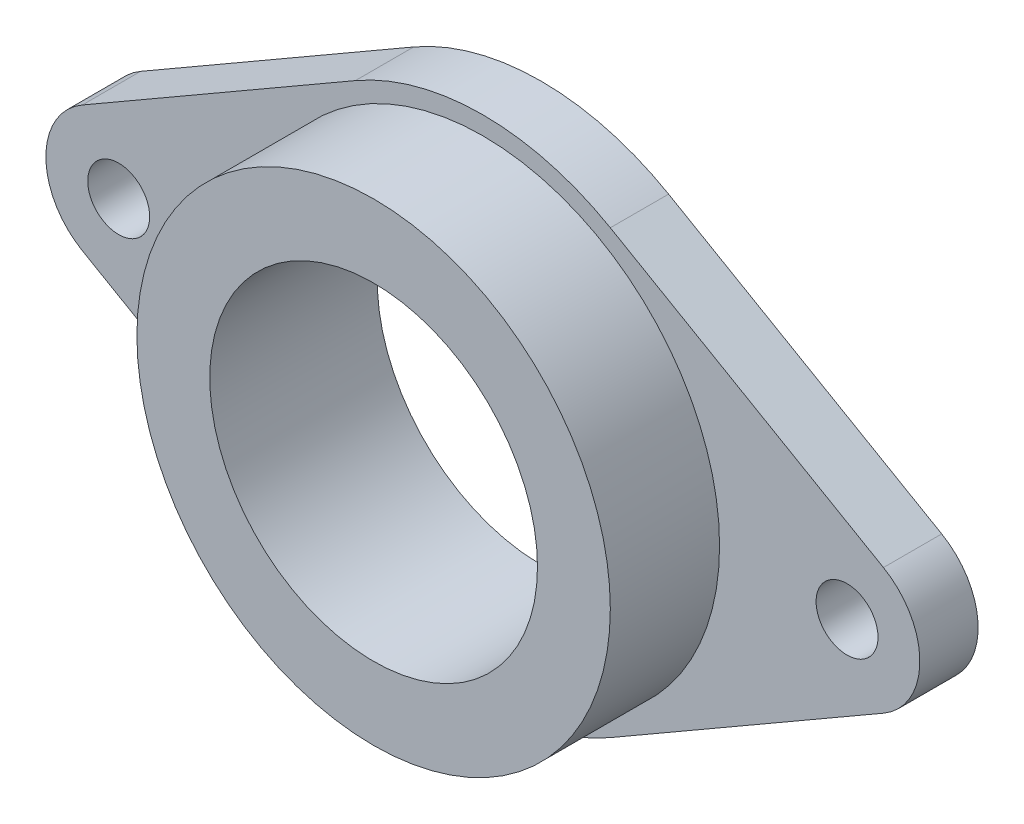
ISO-10303-21;
HEADER;
FILE_DESCRIPTION(('STEP AP214'),'2;1');
FILE_NAME('part.step','',(''),(''),'','','');
FILE_SCHEMA(('AUTOMOTIVE_DESIGN { 1 0 10303 214 1 1 1 1 }'));
ENDSEC;
DATA;
#1=APPLICATION_CONTEXT('core data for automotive mechanical design processes');
#2=APPLICATION_PROTOCOL_DEFINITION('international standard','automotive_design',2000,#1);
#3=PRODUCT_CONTEXT('',#1,'mechanical');
#4=PRODUCT('Part','Part','',(#3));
#5=PRODUCT_RELATED_PRODUCT_CATEGORY('part','',(#4));
#6=PRODUCT_DEFINITION_FORMATION('','',#4);
#7=PRODUCT_DEFINITION_CONTEXT('part definition',#1,'design');
#8=PRODUCT_DEFINITION('design','',#6,#7);
#9=PRODUCT_DEFINITION_SHAPE('','',#8);
#10=(LENGTH_UNIT() NAMED_UNIT(*) SI_UNIT(.MILLI.,.METRE.));
#11=(NAMED_UNIT(*) PLANE_ANGLE_UNIT() SI_UNIT($,.RADIAN.));
#12=(NAMED_UNIT(*) SI_UNIT($,.STERADIAN.) SOLID_ANGLE_UNIT());
#13=UNCERTAINTY_MEASURE_WITH_UNIT(LENGTH_MEASURE(1.E-05),#10,'distance_accuracy_value','');
#14=(GEOMETRIC_REPRESENTATION_CONTEXT(3) GLOBAL_UNCERTAINTY_ASSIGNED_CONTEXT((#13)) GLOBAL_UNIT_ASSIGNED_CONTEXT((#10,
#11,#12)) REPRESENTATION_CONTEXT('',''));
#15=CARTESIAN_POINT('',(0.,0.,0.));
#16=DIRECTION('',(0.,0.,1.));
#17=DIRECTION('',(1.,0.,0.));
#18=AXIS2_PLACEMENT_3D('',#15,#16,#17);
#19=CARTESIAN_POINT('',(17.5,30.3108891324553,8.));
#20=DIRECTION('',(0.5,0.866025403784438,0.));
#21=DIRECTION('',(-0.866025403784439,0.5,0.));
#22=AXIS2_PLACEMENT_3D('',#19,#20,#21);
#23=PLANE('',#22);
#24=DIRECTION('',(0.866025403784439,-0.5,0.));
#25=VECTOR('',#24,1.);
#26=CARTESIAN_POINT('',(17.5,30.3108891324553,0.));
#27=LINE('',#26,#25);
#28=CARTESIAN_POINT('',(17.5,30.3108891324553,0.));
#29=VERTEX_POINT('',#28);
#30=CARTESIAN_POINT('',(55.,8.66025403784437,0.));
#31=VERTEX_POINT('',#30);
#32=EDGE_CURVE('E156',#29,#31,#27,.T.);
#33=ORIENTED_EDGE('',*,*,#32,.F.);
#34=DIRECTION('',(0.,0.,-1.));
#35=VECTOR('',#34,1.);
#36=CARTESIAN_POINT('',(17.5,30.3108891324553,8.));
#37=LINE('',#36,#35);
#38=CARTESIAN_POINT('',(17.5,30.3108891324553,8.));
#39=VERTEX_POINT('',#38);
#40=EDGE_CURVE('E11',#39,#29,#37,.T.);
#41=ORIENTED_EDGE('',*,*,#40,.F.);
#42=DIRECTION('',(0.866025403784439,-0.5,0.));
#43=VECTOR('',#42,1.);
#44=CARTESIAN_POINT('',(17.5,30.3108891324553,8.));
#45=LINE('',#44,#43);
#46=CARTESIAN_POINT('',(55.,8.66025403784437,8.));
#47=VERTEX_POINT('',#46);
#48=EDGE_CURVE('E256',#39,#47,#45,.T.);
#49=ORIENTED_EDGE('',*,*,#48,.T.);
#50=DIRECTION('',(0.,0.,-1.));
#51=VECTOR('',#50,1.);
#52=CARTESIAN_POINT('',(55.,8.66025403784437,8.));
#53=LINE('',#52,#51);
#54=EDGE_CURVE('E58',#47,#31,#53,.T.);
#55=ORIENTED_EDGE('',*,*,#54,.T.);
#56=EDGE_LOOP('',(#33,#41,#49,#55));
#57=FACE_BOUND('',#56,.T.);
#58=ADVANCED_FACE('F41',(#57),#23,.T.);
#59=CARTESIAN_POINT('',(0.,0.,8.));
#60=DIRECTION('',(0.,0.,-1.));
#61=DIRECTION('',(-1.,0.,0.));
#62=AXIS2_PLACEMENT_3D('',#59,#60,#61);
#63=CYLINDRICAL_SURFACE('',#62,35.);
#64=CARTESIAN_POINT('',(0.,0.,0.));
#65=DIRECTION('',(0.,0.,1.));
#66=DIRECTION('',(1.,0.,0.));
#67=AXIS2_PLACEMENT_3D('',#64,#65,#66);
#68=CIRCLE('',#67,35.);
#69=CARTESIAN_POINT('',(-17.5,30.3108891324554,0.));
#70=VERTEX_POINT('',#69);
#71=EDGE_CURVE('E153',#29,#70,#68,.T.);
#72=ORIENTED_EDGE('',*,*,#71,.T.);
#73=DIRECTION('',(0.,0.,-1.));
#74=VECTOR('',#73,1.);
#75=CARTESIAN_POINT('',(-17.5,30.3108891324554,8.));
#76=LINE('',#75,#74);
#77=CARTESIAN_POINT('',(-17.5,30.3108891324554,8.));
#78=VERTEX_POINT('',#77);
#79=EDGE_CURVE('E50',#78,#70,#76,.T.);
#80=ORIENTED_EDGE('',*,*,#79,.F.);
#81=CARTESIAN_POINT('',(0.,0.,8.));
#82=DIRECTION('',(0.,0.,1.));
#83=DIRECTION('',(1.,0.,0.));
#84=AXIS2_PLACEMENT_3D('',#81,#82,#83);
#85=CIRCLE('',#84,35.);
#86=EDGE_CURVE('E258',#39,#78,#85,.T.);
#87=ORIENTED_EDGE('',*,*,#86,.F.);
#88=ORIENTED_EDGE('',*,*,#40,.T.);
#89=EDGE_LOOP('',(#72,#80,#87,#88));
#90=FACE_BOUND('',#89,.T.);
#91=ADVANCED_FACE('F154',(#90),#63,.T.);
#92=CARTESIAN_POINT('',(-17.5,30.3108891324554,8.));
#93=DIRECTION('',(0.5,-0.866025403784438,0.));
#94=DIRECTION('',(0.866025403784438,0.5,0.));
#95=AXIS2_PLACEMENT_3D('',#92,#93,#94);
#96=PLANE('',#95);
#97=DIRECTION('',(-0.866025403784438,-0.5,0.));
#98=VECTOR('',#97,1.);
#99=CARTESIAN_POINT('',(-17.5,30.3108891324554,0.));
#100=LINE('',#99,#98);
#101=CARTESIAN_POINT('',(-55.,8.66025403784439,0.));
#102=VERTEX_POINT('',#101);
#103=EDGE_CURVE('E147',#70,#102,#100,.T.);
#104=ORIENTED_EDGE('',*,*,#103,.T.);
#105=DIRECTION('',(0.,0.,-1.));
#106=VECTOR('',#105,1.);
#107=CARTESIAN_POINT('',(-55.,8.66025403784439,8.));
#108=LINE('',#107,#106);
#109=CARTESIAN_POINT('',(-55.,8.66025403784439,8.));
#110=VERTEX_POINT('',#109);
#111=EDGE_CURVE('E138',#110,#102,#108,.T.);
#112=ORIENTED_EDGE('',*,*,#111,.F.);
#113=DIRECTION('',(-0.866025403784438,-0.5,0.));
#114=VECTOR('',#113,1.);
#115=CARTESIAN_POINT('',(-17.5,30.3108891324554,8.));
#116=LINE('',#115,#114);
#117=EDGE_CURVE('E149',#78,#110,#116,.T.);
#118=ORIENTED_EDGE('',*,*,#117,.F.);
#119=ORIENTED_EDGE('',*,*,#79,.T.);
#120=EDGE_LOOP('',(#104,#112,#118,#119));
#121=FACE_BOUND('',#120,.T.);
#122=ADVANCED_FACE('F145',(#121),#96,.F.);
#123=CARTESIAN_POINT('',(-50.,0.,8.));
#124=DIRECTION('',(0.,0.,-1.));
#125=DIRECTION('',(-1.,0.,0.));
#126=AXIS2_PLACEMENT_3D('',#123,#124,#125);
#127=CYLINDRICAL_SURFACE('',#126,9.99999999999999);
#128=CARTESIAN_POINT('',(-50.,0.,0.));
#129=DIRECTION('',(0.,0.,1.));
#130=DIRECTION('',(1.,0.,0.));
#131=AXIS2_PLACEMENT_3D('',#128,#129,#130);
#132=CIRCLE('',#131,9.99999999999999);
#133=CARTESIAN_POINT('',(-55.,-8.66025403784439,0.));
#134=VERTEX_POINT('',#133);
#135=EDGE_CURVE('E158',#102,#134,#132,.T.);
#136=ORIENTED_EDGE('',*,*,#135,.T.);
#137=DIRECTION('',(0.,0.,-1.));
#138=VECTOR('',#137,1.);
#139=CARTESIAN_POINT('',(-55.,-8.66025403784439,8.));
#140=LINE('',#139,#138);
#141=CARTESIAN_POINT('',(-55.,-8.66025403784439,8.));
#142=VERTEX_POINT('',#141);
#143=EDGE_CURVE('E132',#142,#134,#140,.T.);
#144=ORIENTED_EDGE('',*,*,#143,.F.);
#145=CARTESIAN_POINT('',(-50.,0.,8.));
#146=DIRECTION('',(0.,0.,1.));
#147=DIRECTION('',(1.,0.,0.));
#148=AXIS2_PLACEMENT_3D('',#145,#146,#147);
#149=CIRCLE('',#148,9.99999999999999);
#150=EDGE_CURVE('E261',#110,#142,#149,.T.);
#151=ORIENTED_EDGE('',*,*,#150,.F.);
#152=ORIENTED_EDGE('',*,*,#111,.T.);
#153=EDGE_LOOP('',(#136,#144,#151,#152));
#154=FACE_BOUND('',#153,.T.);
#155=ADVANCED_FACE('F205',(#154),#127,.T.);
#156=CARTESIAN_POINT('',(-17.5,-30.3108891324554,8.));
#157=DIRECTION('',(-0.5,-0.866025403784438,0.));
#158=DIRECTION('',(0.866025403784438,-0.5,0.));
#159=AXIS2_PLACEMENT_3D('',#156,#157,#158);
#160=PLANE('',#159);
#161=DIRECTION('',(-0.866025403784438,0.5,0.));
#162=VECTOR('',#161,1.);
#163=CARTESIAN_POINT('',(-17.5,-30.3108891324554,0.));
#164=LINE('',#163,#162);
#165=CARTESIAN_POINT('',(-17.5,-30.3108891324554,0.));
#166=VERTEX_POINT('',#165);
#167=EDGE_CURVE('E166',#166,#134,#164,.T.);
#168=ORIENTED_EDGE('',*,*,#167,.F.);
#169=DIRECTION('',(0.,0.,-1.));
#170=VECTOR('',#169,1.);
#171=CARTESIAN_POINT('',(-17.5,-30.3108891324554,8.));
#172=LINE('',#171,#170);
#173=CARTESIAN_POINT('',(-17.5,-30.3108891324554,8.));
#174=VERTEX_POINT('',#173);
#175=EDGE_CURVE('E130',#174,#166,#172,.T.);
#176=ORIENTED_EDGE('',*,*,#175,.F.);
#177=DIRECTION('',(-0.866025403784438,0.5,0.));
#178=VECTOR('',#177,1.);
#179=CARTESIAN_POINT('',(-17.5,-30.3108891324554,8.));
#180=LINE('',#179,#178);
#181=EDGE_CURVE('E124',#174,#142,#180,.T.);
#182=ORIENTED_EDGE('',*,*,#181,.T.);
#183=ORIENTED_EDGE('',*,*,#143,.T.);
#184=EDGE_LOOP('',(#168,#176,#182,#183));
#185=FACE_BOUND('',#184,.T.);
#186=ADVANCED_FACE('F208',(#185),#160,.T.);
#187=CARTESIAN_POINT('',(0.,0.,8.));
#188=DIRECTION('',(0.,0.,-1.));
#189=DIRECTION('',(-1.,0.,0.));
#190=AXIS2_PLACEMENT_3D('',#187,#188,#189);
#191=CYLINDRICAL_SURFACE('',#190,35.);
#192=CARTESIAN_POINT('',(0.,0.,0.));
#193=DIRECTION('',(0.,0.,1.));
#194=DIRECTION('',(1.,0.,0.));
#195=AXIS2_PLACEMENT_3D('',#192,#193,#194);
#196=CIRCLE('',#195,35.);
#197=CARTESIAN_POINT('',(17.5,-30.3108891324553,0.));
#198=VERTEX_POINT('',#197);
#199=EDGE_CURVE('E129',#166,#198,#196,.T.);
#200=ORIENTED_EDGE('',*,*,#199,.T.);
#201=DIRECTION('',(0.,0.,-1.));
#202=VECTOR('',#201,1.);
#203=CARTESIAN_POINT('',(17.5,-30.3108891324553,8.));
#204=LINE('',#203,#202);
#205=CARTESIAN_POINT('',(17.5,-30.3108891324553,8.));
#206=VERTEX_POINT('',#205);
#207=EDGE_CURVE('E112',#206,#198,#204,.T.);
#208=ORIENTED_EDGE('',*,*,#207,.F.);
#209=CARTESIAN_POINT('',(0.,0.,8.));
#210=DIRECTION('',(0.,0.,1.));
#211=DIRECTION('',(1.,0.,0.));
#212=AXIS2_PLACEMENT_3D('',#209,#210,#211);
#213=CIRCLE('',#212,35.);
#214=EDGE_CURVE('E117',#174,#206,#213,.T.);
#215=ORIENTED_EDGE('',*,*,#214,.F.);
#216=ORIENTED_EDGE('',*,*,#175,.T.);
#217=EDGE_LOOP('',(#200,#208,#215,#216));
#218=FACE_BOUND('',#217,.T.);
#219=ADVANCED_FACE('F127',(#218),#191,.T.);
#220=CARTESIAN_POINT('',(17.5,-30.3108891324553,8.));
#221=DIRECTION('',(-0.5,0.866025403784438,0.));
#222=DIRECTION('',(-0.866025403784439,-0.5,0.));
#223=AXIS2_PLACEMENT_3D('',#220,#221,#222);
#224=PLANE('',#223);
#225=DIRECTION('',(0.866025403784439,0.5,0.));
#226=VECTOR('',#225,1.);
#227=CARTESIAN_POINT('',(17.5,-30.3108891324553,0.));
#228=LINE('',#227,#226);
#229=CARTESIAN_POINT('',(55.,-8.66025403784437,0.));
#230=VERTEX_POINT('',#229);
#231=EDGE_CURVE('E170',#198,#230,#228,.T.);
#232=ORIENTED_EDGE('',*,*,#231,.T.);
#233=DIRECTION('',(0.,0.,-1.));
#234=VECTOR('',#233,1.);
#235=CARTESIAN_POINT('',(55.,-8.66025403784437,8.));
#236=LINE('',#235,#234);
#237=CARTESIAN_POINT('',(55.,-8.66025403784437,8.));
#238=VERTEX_POINT('',#237);
#239=EDGE_CURVE('E84',#238,#230,#236,.T.);
#240=ORIENTED_EDGE('',*,*,#239,.F.);
#241=DIRECTION('',(0.866025403784439,0.5,0.));
#242=VECTOR('',#241,1.);
#243=CARTESIAN_POINT('',(17.5,-30.3108891324553,8.));
#244=LINE('',#243,#242);
#245=EDGE_CURVE('E108',#206,#238,#244,.T.);
#246=ORIENTED_EDGE('',*,*,#245,.F.);
#247=ORIENTED_EDGE('',*,*,#207,.T.);
#248=EDGE_LOOP('',(#232,#240,#246,#247));
#249=FACE_BOUND('',#248,.T.);
#250=ADVANCED_FACE('F110',(#249),#224,.F.);
#251=CARTESIAN_POINT('',(-50.,0.,8.));
#252=DIRECTION('',(0.,0.,-1.));
#253=DIRECTION('',(-1.,0.,0.));
#254=AXIS2_PLACEMENT_3D('',#251,#252,#253);
#255=CYLINDRICAL_SURFACE('',#254,4.25000000000001);
#256=CARTESIAN_POINT('',(-50.,0.,8.));
#257=DIRECTION('',(0.,0.,1.));
#258=DIRECTION('',(1.,0.,0.));
#259=AXIS2_PLACEMENT_3D('',#256,#257,#258);
#260=CIRCLE('',#259,4.25000000000001);
#261=CARTESIAN_POINT('',(-45.75,0.,8.));
#262=VERTEX_POINT('',#261);
#263=EDGE_CURVE('E251',#262,#262,#260,.T.);
#264=ORIENTED_EDGE('',*,*,#263,.T.);
#265=EDGE_LOOP('',(#264));
#266=FACE_BOUND('',#265,.T.);
#267=CARTESIAN_POINT('',(-50.,0.,0.));
#268=DIRECTION('',(0.,0.,1.));
#269=DIRECTION('',(1.,0.,0.));
#270=AXIS2_PLACEMENT_3D('',#267,#268,#269);
#271=CIRCLE('',#270,4.25000000000001);
#272=CARTESIAN_POINT('',(-45.75,0.,0.));
#273=VERTEX_POINT('',#272);
#274=EDGE_CURVE('E160',#273,#273,#271,.T.);
#275=ORIENTED_EDGE('',*,*,#274,.F.);
#276=EDGE_LOOP('',(#275));
#277=FACE_BOUND('',#276,.T.);
#278=ADVANCED_FACE('F185',(#266,#277),#255,.F.);
#279=CARTESIAN_POINT('',(50.,0.,8.));
#280=DIRECTION('',(0.,0.,-1.));
#281=DIRECTION('',(-1.,0.,0.));
#282=AXIS2_PLACEMENT_3D('',#279,#280,#281);
#283=CYLINDRICAL_SURFACE('',#282,4.25000000000001);
#284=CARTESIAN_POINT('',(50.,0.,8.));
#285=DIRECTION('',(0.,0.,1.));
#286=DIRECTION('',(1.,0.,0.));
#287=AXIS2_PLACEMENT_3D('',#284,#285,#286);
#288=CIRCLE('',#287,4.25000000000001);
#289=CARTESIAN_POINT('',(54.25,0.,8.));
#290=VERTEX_POINT('',#289);
#291=EDGE_CURVE('E174',#290,#290,#288,.F.);
#292=ORIENTED_EDGE('',*,*,#291,.F.);
#293=EDGE_LOOP('',(#292));
#294=FACE_BOUND('',#293,.T.);
#295=CARTESIAN_POINT('',(50.,0.,0.));
#296=DIRECTION('',(0.,0.,1.));
#297=DIRECTION('',(1.,0.,0.));
#298=AXIS2_PLACEMENT_3D('',#295,#296,#297);
#299=CIRCLE('',#298,4.25000000000001);
#300=CARTESIAN_POINT('',(54.25,0.,0.));
#301=VERTEX_POINT('',#300);
#302=EDGE_CURVE('E177',#301,#301,#299,.F.);
#303=ORIENTED_EDGE('',*,*,#302,.T.);
#304=EDGE_LOOP('',(#303));
#305=FACE_BOUND('',#304,.T.);
#306=ADVANCED_FACE('F43',(#294,#305),#283,.F.);
#307=CARTESIAN_POINT('',(50.,0.,8.));
#308=DIRECTION('',(0.,0.,-1.));
#309=DIRECTION('',(-1.,0.,0.));
#310=AXIS2_PLACEMENT_3D('',#307,#308,#309);
#311=CYLINDRICAL_SURFACE('',#310,9.99999999999998);
#312=CARTESIAN_POINT('',(50.,0.,0.));
#313=DIRECTION('',(0.,0.,1.));
#314=DIRECTION('',(1.,0.,0.));
#315=AXIS2_PLACEMENT_3D('',#312,#313,#314);
#316=CIRCLE('',#315,9.99999999999998);
#317=EDGE_CURVE('E172',#31,#230,#316,.F.);
#318=ORIENTED_EDGE('',*,*,#317,.F.);
#319=ORIENTED_EDGE('',*,*,#54,.F.);
#320=CARTESIAN_POINT('',(50.,0.,8.));
#321=DIRECTION('',(0.,0.,1.));
#322=DIRECTION('',(1.,0.,0.));
#323=AXIS2_PLACEMENT_3D('',#320,#321,#322);
#324=CIRCLE('',#323,9.99999999999998);
#325=EDGE_CURVE('E116',#47,#238,#324,.F.);
#326=ORIENTED_EDGE('',*,*,#325,.T.);
#327=ORIENTED_EDGE('',*,*,#239,.T.);
#328=EDGE_LOOP('',(#318,#319,#326,#327));
#329=FACE_BOUND('',#328,.T.);
#330=ADVANCED_FACE('F192',(#329),#311,.T.);
#331=CARTESIAN_POINT('',(0.,0.,8.));
#332=DIRECTION('',(0.,0.,1.));
#333=DIRECTION('',(1.,0.,0.));
#334=AXIS2_PLACEMENT_3D('',#331,#332,#333);
#335=PLANE('',#334);
#336=ORIENTED_EDGE('',*,*,#291,.T.);
#337=EDGE_LOOP('',(#336));
#338=FACE_BOUND('',#337,.T.);
#339=ORIENTED_EDGE('',*,*,#263,.F.);
#340=EDGE_LOOP('',(#339));
#341=FACE_BOUND('',#340,.T.);
#342=CARTESIAN_POINT('',(0.,0.,8.));
#343=DIRECTION('',(0.,0.,1.));
#344=DIRECTION('',(1.,0.,0.));
#345=AXIS2_PLACEMENT_3D('',#342,#343,#344);
#346=CIRCLE('',#345,32.5);
#347=CARTESIAN_POINT('',(32.5,0.,8.));
#348=VERTEX_POINT('',#347);
#349=EDGE_CURVE('E253',#348,#348,#346,.T.);
#350=ORIENTED_EDGE('',*,*,#349,.F.);
#351=EDGE_LOOP('',(#350));
#352=FACE_BOUND('',#351,.T.);
#353=ORIENTED_EDGE('',*,*,#48,.F.);
#354=ORIENTED_EDGE('',*,*,#86,.T.);
#355=ORIENTED_EDGE('',*,*,#117,.T.);
#356=ORIENTED_EDGE('',*,*,#150,.T.);
#357=ORIENTED_EDGE('',*,*,#181,.F.);
#358=ORIENTED_EDGE('',*,*,#214,.T.);
#359=ORIENTED_EDGE('',*,*,#245,.T.);
#360=ORIENTED_EDGE('',*,*,#325,.F.);
#361=EDGE_LOOP('',(#353,#354,#355,#356,#357,#358,#359,#360));
#362=FACE_BOUND('',#361,.T.);
#363=ADVANCED_FACE('F122',(#338,#341,#352,#362),#335,.T.);
#364=CARTESIAN_POINT('',(0.,0.,0.));
#365=DIRECTION('',(0.,0.,1.));
#366=DIRECTION('',(1.,0.,0.));
#367=AXIS2_PLACEMENT_3D('',#364,#365,#366);
#368=PLANE('',#367);
#369=ORIENTED_EDGE('',*,*,#302,.F.);
#370=EDGE_LOOP('',(#369));
#371=FACE_BOUND('',#370,.T.);
#372=ORIENTED_EDGE('',*,*,#274,.T.);
#373=EDGE_LOOP('',(#372));
#374=FACE_BOUND('',#373,.T.);
#375=ORIENTED_EDGE('',*,*,#32,.T.);
#376=ORIENTED_EDGE('',*,*,#317,.T.);
#377=ORIENTED_EDGE('',*,*,#231,.F.);
#378=ORIENTED_EDGE('',*,*,#199,.F.);
#379=ORIENTED_EDGE('',*,*,#167,.T.);
#380=ORIENTED_EDGE('',*,*,#135,.F.);
#381=ORIENTED_EDGE('',*,*,#103,.F.);
#382=ORIENTED_EDGE('',*,*,#71,.F.);
#383=EDGE_LOOP('',(#375,#376,#377,#378,#379,#380,#381,#382));
#384=FACE_BOUND('',#383,.T.);
#385=CARTESIAN_POINT('',(0.,0.,0.));
#386=DIRECTION('',(0.,0.,1.));
#387=DIRECTION('',(1.,0.,0.));
#388=AXIS2_PLACEMENT_3D('',#385,#386,#387);
#389=CIRCLE('',#388,22.5);
#390=CARTESIAN_POINT('',(22.5,0.,0.));
#391=VERTEX_POINT('',#390);
#392=EDGE_CURVE('E244',#391,#391,#389,.T.);
#393=ORIENTED_EDGE('',*,*,#392,.T.);
#394=EDGE_LOOP('',(#393));
#395=FACE_BOUND('',#394,.T.);
#396=ADVANCED_FACE('F183',(#371,#374,#384,#395),#368,.F.);
#397=CARTESIAN_POINT('',(0.,0.,23.));
#398=DIRECTION('',(0.,0.,-1.));
#399=DIRECTION('',(-1.,0.,0.));
#400=AXIS2_PLACEMENT_3D('',#397,#398,#399);
#401=CYLINDRICAL_SURFACE('',#400,22.5);
#402=CARTESIAN_POINT('',(0.,0.,23.));
#403=DIRECTION('',(0.,0.,1.));
#404=DIRECTION('',(1.,0.,0.));
#405=AXIS2_PLACEMENT_3D('',#402,#403,#404);
#406=CIRCLE('',#405,22.5);
#407=CARTESIAN_POINT('',(22.5,0.,23.));
#408=VERTEX_POINT('',#407);
#409=EDGE_CURVE('E239',#408,#408,#406,.T.);
#410=ORIENTED_EDGE('',*,*,#409,.T.);
#411=EDGE_LOOP('',(#410));
#412=FACE_BOUND('',#411,.T.);
#413=ORIENTED_EDGE('',*,*,#392,.F.);
#414=EDGE_LOOP('',(#413));
#415=FACE_BOUND('',#414,.T.);
#416=ADVANCED_FACE('F219',(#412,#415),#401,.F.);
#417=CARTESIAN_POINT('',(0.,0.,23.));
#418=DIRECTION('',(0.,0.,-1.));
#419=DIRECTION('',(-1.,0.,0.));
#420=AXIS2_PLACEMENT_3D('',#417,#418,#419);
#421=CYLINDRICAL_SURFACE('',#420,32.5);
#422=ORIENTED_EDGE('',*,*,#349,.T.);
#423=EDGE_LOOP('',(#422));
#424=FACE_BOUND('',#423,.T.);
#425=CARTESIAN_POINT('',(0.,0.,23.));
#426=DIRECTION('',(0.,0.,1.));
#427=DIRECTION('',(1.,0.,0.));
#428=AXIS2_PLACEMENT_3D('',#425,#426,#427);
#429=CIRCLE('',#428,32.5);
#430=CARTESIAN_POINT('',(32.5,0.,23.));
#431=VERTEX_POINT('',#430);
#432=EDGE_CURVE('E179',#431,#431,#429,.T.);
#433=ORIENTED_EDGE('',*,*,#432,.F.);
#434=EDGE_LOOP('',(#433));
#435=FACE_BOUND('',#434,.T.);
#436=ADVANCED_FACE('F226',(#424,#435),#421,.T.);
#437=CARTESIAN_POINT('',(0.,0.,23.));
#438=DIRECTION('',(0.,0.,1.));
#439=DIRECTION('',(1.,0.,0.));
#440=AXIS2_PLACEMENT_3D('',#437,#438,#439);
#441=PLANE('',#440);
#442=ORIENTED_EDGE('',*,*,#409,.F.);
#443=EDGE_LOOP('',(#442));
#444=FACE_BOUND('',#443,.T.);
#445=ORIENTED_EDGE('',*,*,#432,.T.);
#446=EDGE_LOOP('',(#445));
#447=FACE_BOUND('',#446,.T.);
#448=ADVANCED_FACE('F230',(#444,#447),#441,.T.);
#449=CLOSED_SHELL('',(#58,#91,#122,#155,#186,#219,#250,#278,#306,#330,#363,#396,#416,#436,#448));
#450=MANIFOLD_SOLID_BREP('B2',#449);
#451=ADVANCED_BREP_SHAPE_REPRESENTATION('',(#18,#450),#14);
#452=SHAPE_DEFINITION_REPRESENTATION(#9,#451);
ENDSEC;
END-ISO-10303-21;
